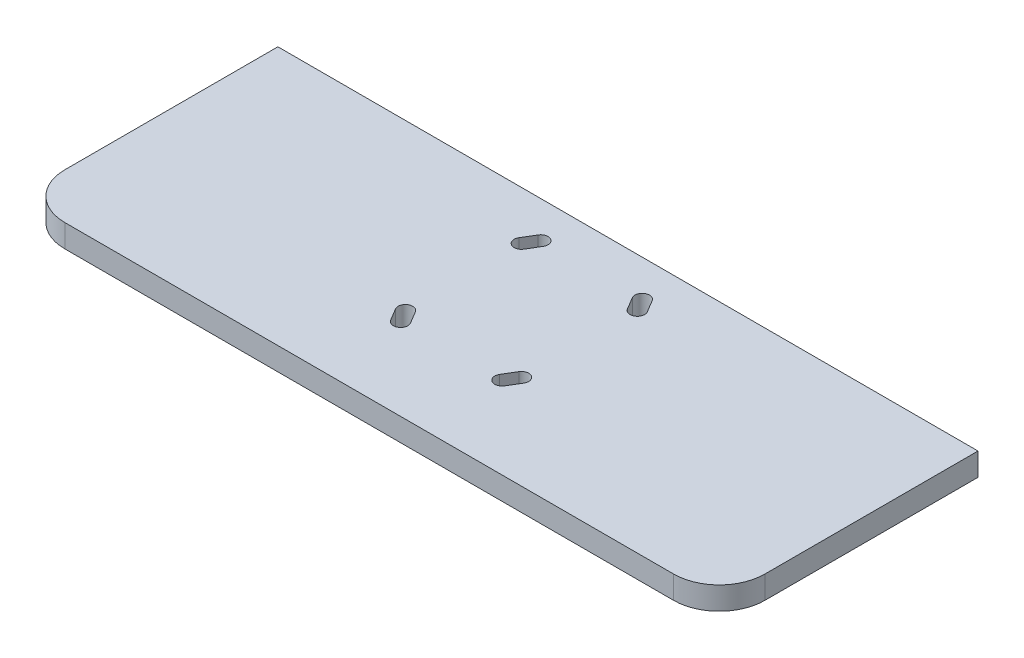
ISO-10303-21;
HEADER;
FILE_DESCRIPTION(('STEP AP214'),'2;1');
FILE_NAME('part.step','',(''),(''),'','','');
FILE_SCHEMA(('AUTOMOTIVE_DESIGN { 1 0 10303 214 1 1 1 1 }'));
ENDSEC;
DATA;
#1=APPLICATION_CONTEXT('core data for automotive mechanical design processes');
#2=APPLICATION_PROTOCOL_DEFINITION('international standard','automotive_design',2000,#1);
#3=PRODUCT_CONTEXT('',#1,'mechanical');
#4=PRODUCT('Part','Part','',(#3));
#5=PRODUCT_RELATED_PRODUCT_CATEGORY('part','',(#4));
#6=PRODUCT_DEFINITION_FORMATION('','',#4);
#7=PRODUCT_DEFINITION_CONTEXT('part definition',#1,'design');
#8=PRODUCT_DEFINITION('design','',#6,#7);
#9=PRODUCT_DEFINITION_SHAPE('','',#8);
#10=(LENGTH_UNIT() NAMED_UNIT(*) SI_UNIT(.MILLI.,.METRE.));
#11=(NAMED_UNIT(*) PLANE_ANGLE_UNIT() SI_UNIT($,.RADIAN.));
#12=(NAMED_UNIT(*) SI_UNIT($,.STERADIAN.) SOLID_ANGLE_UNIT());
#13=UNCERTAINTY_MEASURE_WITH_UNIT(LENGTH_MEASURE(1.E-05),#10,'distance_accuracy_value','');
#14=(GEOMETRIC_REPRESENTATION_CONTEXT(3) GLOBAL_UNCERTAINTY_ASSIGNED_CONTEXT((#13)) GLOBAL_UNIT_ASSIGNED_CONTEXT((#10,
#11,#12)) REPRESENTATION_CONTEXT('',''));
#15=CARTESIAN_POINT('',(0.,0.,0.));
#16=DIRECTION('',(0.,0.,1.));
#17=DIRECTION('',(1.,0.,0.));
#18=AXIS2_PLACEMENT_3D('',#15,#16,#17);
#19=CARTESIAN_POINT('',(230.,15.,70.));
#20=DIRECTION('',(-1.,0.,0.));
#21=DIRECTION('',(0.,0.,1.));
#22=AXIS2_PLACEMENT_3D('',#19,#20,#21);
#23=PLANE('',#22);
#24=DIRECTION('',(0.,0.,-1.));
#25=VECTOR('',#24,1.);
#26=CARTESIAN_POINT('',(230.,0.,70.));
#27=LINE('',#26,#25);
#28=CARTESIAN_POINT('',(230.,0.,70.));
#29=VERTEX_POINT('',#28);
#30=CARTESIAN_POINT('',(230.,0.,-70.));
#31=VERTEX_POINT('',#30);
#32=EDGE_CURVE('E202',#29,#31,#27,.T.);
#33=ORIENTED_EDGE('',*,*,#32,.T.);
#34=DIRECTION('',(0.,1.,0.));
#35=VECTOR('',#34,1.);
#36=CARTESIAN_POINT('',(230.,15.,-69.9999999999999));
#37=LINE('',#36,#35);
#38=CARTESIAN_POINT('',(230.,15.,-69.9999999999999));
#39=VERTEX_POINT('',#38);
#40=EDGE_CURVE('E50',#31,#39,#37,.T.);
#41=ORIENTED_EDGE('',*,*,#40,.T.);
#42=DIRECTION('',(0.,0.,-1.));
#43=VECTOR('',#42,1.);
#44=CARTESIAN_POINT('',(230.,15.,70.));
#45=LINE('',#44,#43);
#46=CARTESIAN_POINT('',(230.,15.,70.));
#47=VERTEX_POINT('',#46);
#48=EDGE_CURVE('E213',#47,#39,#45,.T.);
#49=ORIENTED_EDGE('',*,*,#48,.F.);
#50=DIRECTION('',(0.,-1.,0.));
#51=VECTOR('',#50,1.);
#52=CARTESIAN_POINT('',(230.,15.,70.));
#53=LINE('',#52,#51);
#54=EDGE_CURVE('E214',#47,#29,#53,.T.);
#55=ORIENTED_EDGE('',*,*,#54,.T.);
#56=EDGE_LOOP('',(#33,#41,#49,#55));
#57=FACE_BOUND('',#56,.T.);
#58=ADVANCED_FACE('F37',(#57),#23,.F.);
#59=CARTESIAN_POINT('',(-230.,15.,70.));
#60=DIRECTION('',(1.,0.,0.));
#61=DIRECTION('',(0.,0.,-1.));
#62=AXIS2_PLACEMENT_3D('',#59,#60,#61);
#63=PLANE('',#62);
#64=DIRECTION('',(0.,0.,1.));
#65=VECTOR('',#64,1.);
#66=CARTESIAN_POINT('',(-230.,15.,70.));
#67=LINE('',#66,#65);
#68=CARTESIAN_POINT('',(-230.,15.,-70.));
#69=VERTEX_POINT('',#68);
#70=CARTESIAN_POINT('',(-230.,15.,70.));
#71=VERTEX_POINT('',#70);
#72=EDGE_CURVE('E195',#69,#71,#67,.T.);
#73=ORIENTED_EDGE('',*,*,#72,.F.);
#74=DIRECTION('',(0.,-1.,0.));
#75=VECTOR('',#74,1.);
#76=CARTESIAN_POINT('',(-230.,15.,-70.));
#77=LINE('',#76,#75);
#78=CARTESIAN_POINT('',(-230.,0.,-70.));
#79=VERTEX_POINT('',#78);
#80=EDGE_CURVE('E183',#69,#79,#77,.T.);
#81=ORIENTED_EDGE('',*,*,#80,.T.);
#82=DIRECTION('',(0.,0.,1.));
#83=VECTOR('',#82,1.);
#84=CARTESIAN_POINT('',(-230.,0.,70.));
#85=LINE('',#84,#83);
#86=CARTESIAN_POINT('',(-230.,0.,70.));
#87=VERTEX_POINT('',#86);
#88=EDGE_CURVE('E193',#79,#87,#85,.T.);
#89=ORIENTED_EDGE('',*,*,#88,.T.);
#90=DIRECTION('',(0.,-1.,0.));
#91=VECTOR('',#90,1.);
#92=CARTESIAN_POINT('',(-230.,15.,70.));
#93=LINE('',#92,#91);
#94=EDGE_CURVE('E44',#71,#87,#93,.T.);
#95=ORIENTED_EDGE('',*,*,#94,.F.);
#96=EDGE_LOOP('',(#73,#81,#89,#95));
#97=FACE_BOUND('',#96,.T.);
#98=ADVANCED_FACE('F191',(#97),#63,.F.);
#99=CARTESIAN_POINT('',(-200.,15.,70.));
#100=DIRECTION('',(0.,-1.,0.));
#101=DIRECTION('',(0.,0.,-1.));
#102=AXIS2_PLACEMENT_3D('',#99,#100,#101);
#103=CYLINDRICAL_SURFACE('',#102,30.);
#104=CARTESIAN_POINT('',(-200.,0.,70.));
#105=DIRECTION('',(0.,1.,0.));
#106=DIRECTION('',(0.,0.,-1.));
#107=AXIS2_PLACEMENT_3D('',#104,#105,#106);
#108=CIRCLE('',#107,30.);
#109=CARTESIAN_POINT('',(-200.,0.,100.));
#110=VERTEX_POINT('',#109);
#111=EDGE_CURVE('E201',#87,#110,#108,.T.);
#112=ORIENTED_EDGE('',*,*,#111,.T.);
#113=DIRECTION('',(0.,-1.,0.));
#114=VECTOR('',#113,1.);
#115=CARTESIAN_POINT('',(-200.,15.,100.));
#116=LINE('',#115,#114);
#117=CARTESIAN_POINT('',(-200.,15.,100.));
#118=VERTEX_POINT('',#117);
#119=EDGE_CURVE('E221',#118,#110,#116,.T.);
#120=ORIENTED_EDGE('',*,*,#119,.F.);
#121=CARTESIAN_POINT('',(-200.,15.,70.));
#122=DIRECTION('',(0.,1.,0.));
#123=DIRECTION('',(0.,0.,-1.));
#124=AXIS2_PLACEMENT_3D('',#121,#122,#123);
#125=CIRCLE('',#124,30.);
#126=EDGE_CURVE('E227',#71,#118,#125,.T.);
#127=ORIENTED_EDGE('',*,*,#126,.F.);
#128=ORIENTED_EDGE('',*,*,#94,.T.);
#129=EDGE_LOOP('',(#112,#120,#127,#128));
#130=FACE_BOUND('',#129,.T.);
#131=ADVANCED_FACE('F225',(#130),#103,.T.);
#132=CARTESIAN_POINT('',(-200.,15.,100.));
#133=DIRECTION('',(0.,0.,-1.));
#134=DIRECTION('',(-1.,0.,0.));
#135=AXIS2_PLACEMENT_3D('',#132,#133,#134);
#136=PLANE('',#135);
#137=DIRECTION('',(1.,0.,0.));
#138=VECTOR('',#137,1.);
#139=CARTESIAN_POINT('',(-200.,0.,100.));
#140=LINE('',#139,#138);
#141=CARTESIAN_POINT('',(200.,0.,100.));
#142=VERTEX_POINT('',#141);
#143=EDGE_CURVE('E204',#110,#142,#140,.T.);
#144=ORIENTED_EDGE('',*,*,#143,.T.);
#145=DIRECTION('',(0.,-1.,0.));
#146=VECTOR('',#145,1.);
#147=CARTESIAN_POINT('',(200.,15.,100.));
#148=LINE('',#147,#146);
#149=CARTESIAN_POINT('',(200.,15.,100.));
#150=VERTEX_POINT('',#149);
#151=EDGE_CURVE('E217',#150,#142,#148,.T.);
#152=ORIENTED_EDGE('',*,*,#151,.F.);
#153=DIRECTION('',(1.,0.,0.));
#154=VECTOR('',#153,1.);
#155=CARTESIAN_POINT('',(-200.,15.,100.));
#156=LINE('',#155,#154);
#157=EDGE_CURVE('E230',#118,#150,#156,.T.);
#158=ORIENTED_EDGE('',*,*,#157,.F.);
#159=ORIENTED_EDGE('',*,*,#119,.T.);
#160=EDGE_LOOP('',(#144,#152,#158,#159));
#161=FACE_BOUND('',#160,.T.);
#162=ADVANCED_FACE('F431',(#161),#136,.F.);
#163=CARTESIAN_POINT('',(200.,15.,70.));
#164=DIRECTION('',(0.,-1.,0.));
#165=DIRECTION('',(0.,0.,-1.));
#166=AXIS2_PLACEMENT_3D('',#163,#164,#165);
#167=CYLINDRICAL_SURFACE('',#166,30.);
#168=CARTESIAN_POINT('',(200.,0.,70.));
#169=DIRECTION('',(0.,1.,0.));
#170=DIRECTION('',(0.,0.,1.));
#171=AXIS2_PLACEMENT_3D('',#168,#169,#170);
#172=CIRCLE('',#171,30.);
#173=EDGE_CURVE('E211',#142,#29,#172,.T.);
#174=ORIENTED_EDGE('',*,*,#173,.T.);
#175=ORIENTED_EDGE('',*,*,#54,.F.);
#176=CARTESIAN_POINT('',(200.,15.,70.));
#177=DIRECTION('',(0.,1.,0.));
#178=DIRECTION('',(0.,0.,1.));
#179=AXIS2_PLACEMENT_3D('',#176,#177,#178);
#180=CIRCLE('',#179,30.);
#181=EDGE_CURVE('E218',#150,#47,#180,.T.);
#182=ORIENTED_EDGE('',*,*,#181,.F.);
#183=ORIENTED_EDGE('',*,*,#151,.T.);
#184=EDGE_LOOP('',(#174,#175,#182,#183));
#185=FACE_BOUND('',#184,.T.);
#186=ADVANCED_FACE('F242',(#185),#167,.T.);
#187=CARTESIAN_POINT('',(-200.,15.,70.));
#188=DIRECTION('',(0.,-1.,0.));
#189=DIRECTION('',(0.,0.,-1.));
#190=AXIS2_PLACEMENT_3D('',#187,#188,#189);
#191=PLANE('',#190);
#192=DIRECTION('',(0.514495755427524,0.,0.857492925712546));
#193=VECTOR('',#192,1.);
#194=CARTESIAN_POINT('',(-42.1838100587061,15.,40.5502860352223));
#195=LINE('',#194,#193);
#196=CARTESIAN_POINT('',(-42.1838100587061,15.,40.5502860352223));
#197=VERTEX_POINT('',#196);
#198=CARTESIAN_POINT('',(-37.4213100587049,15.,48.4877860352244));
#199=VERTEX_POINT('',#198);
#200=EDGE_CURVE('E261',#197,#199,#195,.T.);
#201=ORIENTED_EDGE('',*,*,#200,.F.);
#202=CARTESIAN_POINT('',(-38.1000000000001,15.,38.0999999999987));
#203=DIRECTION('',(0.,1.,0.));
#204=DIRECTION('',(0.,0.,1.));
#205=AXIS2_PLACEMENT_3D('',#202,#203,#204);
#206=CIRCLE('',#205,4.7625);
#207=CARTESIAN_POINT('',(-34.0161899412941,15.,35.6497139647752));
#208=VERTEX_POINT('',#207);
#209=EDGE_CURVE('E58',#208,#197,#206,.T.);
#210=ORIENTED_EDGE('',*,*,#209,.F.);
#211=DIRECTION('',(-0.514495755427524,0.,-0.857492925712546));
#212=VECTOR('',#211,1.);
#213=CARTESIAN_POINT('',(-34.0161899412941,15.,35.6497139647752));
#214=LINE('',#213,#212);
#215=CARTESIAN_POINT('',(-29.2536899412929,15.,43.5872139647772));
#216=VERTEX_POINT('',#215);
#217=EDGE_CURVE('E254',#216,#208,#214,.T.);
#218=ORIENTED_EDGE('',*,*,#217,.F.);
#219=CARTESIAN_POINT('',(-33.3374999999989,15.,46.0375000000008));
#220=DIRECTION('',(0.,1.,0.));
#221=DIRECTION('',(0.,0.,1.));
#222=AXIS2_PLACEMENT_3D('',#219,#220,#221);
#223=CIRCLE('',#222,4.7625);
#224=EDGE_CURVE('E258',#199,#216,#223,.T.);
#225=ORIENTED_EDGE('',*,*,#224,.F.);
#226=EDGE_LOOP('',(#201,#210,#218,#225));
#227=FACE_BOUND('',#226,.T.);
#228=DIRECTION('',(-0.51449575542756,0.,-0.857492925712524));
#229=VECTOR('',#228,1.);
#230=CARTESIAN_POINT('',(42.1838100587054,15.,-40.5502860352235));
#231=LINE('',#230,#229);
#232=CARTESIAN_POINT('',(42.1838100587054,15.,-40.5502860352235));
#233=VERTEX_POINT('',#232);
#234=CARTESIAN_POINT('',(37.4213100587051,15.,-48.4877860352233));
#235=VERTEX_POINT('',#234);
#236=EDGE_CURVE('E356',#233,#235,#231,.T.);
#237=ORIENTED_EDGE('',*,*,#236,.F.);
#238=CARTESIAN_POINT('',(38.0999999999997,15.,-38.0999999999999));
#239=DIRECTION('',(0.,1.,0.));
#240=DIRECTION('',(0.,0.,1.));
#241=AXIS2_PLACEMENT_3D('',#238,#239,#240);
#242=CIRCLE('',#241,4.76249999999982);
#243=CARTESIAN_POINT('',(34.0161899412939,15.,-35.6497139647762));
#244=VERTEX_POINT('',#243);
#245=EDGE_CURVE('E359',#244,#233,#242,.T.);
#246=ORIENTED_EDGE('',*,*,#245,.F.);
#247=DIRECTION('',(0.51449575542756,0.,0.857492925712524));
#248=VECTOR('',#247,1.);
#249=CARTESIAN_POINT('',(34.0161899412939,15.,-35.6497139647762));
#250=LINE('',#249,#248);
#251=CARTESIAN_POINT('',(29.2536899412936,15.,-43.587213964776));
#252=VERTEX_POINT('',#251);
#253=EDGE_CURVE('E349',#252,#244,#250,.T.);
#254=ORIENTED_EDGE('',*,*,#253,.F.);
#255=CARTESIAN_POINT('',(33.3374999999994,15.,-46.0374999999997));
#256=DIRECTION('',(0.,1.,0.));
#257=DIRECTION('',(0.,0.,1.));
#258=AXIS2_PLACEMENT_3D('',#255,#256,#257);
#259=CIRCLE('',#258,4.76249999999982);
#260=EDGE_CURVE('E353',#235,#252,#259,.T.);
#261=ORIENTED_EDGE('',*,*,#260,.F.);
#262=EDGE_LOOP('',(#237,#246,#254,#261));
#263=FACE_BOUND('',#262,.T.);
#264=DIRECTION('',(0.514495755427523,0.,-0.857492925712546));
#265=VECTOR('',#264,1.);
#266=CARTESIAN_POINT('',(-34.0161899412935,15.,-35.6497139647762));
#267=LINE('',#266,#265);
#268=CARTESIAN_POINT('',(-34.0161899412935,15.,-35.6497139647762));
#269=VERTEX_POINT('',#268);
#270=CARTESIAN_POINT('',(-29.2536899412935,15.,-43.5872139647762));
#271=VERTEX_POINT('',#270);
#272=EDGE_CURVE('E294',#269,#271,#267,.T.);
#273=ORIENTED_EDGE('',*,*,#272,.F.);
#274=CARTESIAN_POINT('',(-38.0999999999995,15.,-38.0999999999998));
#275=DIRECTION('',(0.,1.,0.));
#276=DIRECTION('',(0.,0.,-1.));
#277=AXIS2_PLACEMENT_3D('',#274,#275,#276);
#278=CIRCLE('',#277,4.76250000000001);
#279=CARTESIAN_POINT('',(-42.1838100587055,15.,-40.5502860352233));
#280=VERTEX_POINT('',#279);
#281=EDGE_CURVE('E297',#280,#269,#278,.T.);
#282=ORIENTED_EDGE('',*,*,#281,.F.);
#283=DIRECTION('',(-0.514495755427523,0.,0.857492925712546));
#284=VECTOR('',#283,1.);
#285=CARTESIAN_POINT('',(-42.1838100587055,15.,-40.5502860352233));
#286=LINE('',#285,#284);
#287=CARTESIAN_POINT('',(-37.4213100587055,15.,-48.4877860352234));
#288=VERTEX_POINT('',#287);
#289=EDGE_CURVE('E287',#288,#280,#286,.T.);
#290=ORIENTED_EDGE('',*,*,#289,.F.);
#291=CARTESIAN_POINT('',(-33.3374999999995,15.,-46.0374999999998));
#292=DIRECTION('',(0.,1.,0.));
#293=DIRECTION('',(0.,0.,-1.));
#294=AXIS2_PLACEMENT_3D('',#291,#292,#293);
#295=CIRCLE('',#294,4.76250000000001);
#296=EDGE_CURVE('E291',#271,#288,#295,.T.);
#297=ORIENTED_EDGE('',*,*,#296,.F.);
#298=EDGE_LOOP('',(#273,#282,#290,#297));
#299=FACE_BOUND('',#298,.T.);
#300=DIRECTION('',(-0.514495755427526,0.,0.857492925712545));
#301=VECTOR('',#300,1.);
#302=CARTESIAN_POINT('',(34.0161899412934,15.,35.6497139647765));
#303=LINE('',#302,#301);
#304=CARTESIAN_POINT('',(34.0161899412934,15.,35.6497139647764));
#305=VERTEX_POINT('',#304);
#306=CARTESIAN_POINT('',(29.2536899412937,15.,43.587213964776));
#307=VERTEX_POINT('',#306);
#308=EDGE_CURVE('E326',#305,#307,#303,.T.);
#309=ORIENTED_EDGE('',*,*,#308,.F.);
#310=CARTESIAN_POINT('',(38.0999999999994,15.,38.1));
#311=DIRECTION('',(0.,1.,0.));
#312=DIRECTION('',(0.,0.,-1.));
#313=AXIS2_PLACEMENT_3D('',#310,#311,#312);
#314=CIRCLE('',#313,4.76249999999992);
#315=CARTESIAN_POINT('',(42.1838100587053,15.,40.5502860352236));
#316=VERTEX_POINT('',#315);
#317=EDGE_CURVE('E286',#316,#305,#314,.T.);
#318=ORIENTED_EDGE('',*,*,#317,.F.);
#319=DIRECTION('',(0.514495755427526,0.,-0.857492925712545));
#320=VECTOR('',#319,1.);
#321=CARTESIAN_POINT('',(42.1838100587053,15.,40.5502860352236));
#322=LINE('',#321,#320);
#323=CARTESIAN_POINT('',(37.4213100587056,15.,48.4877860352231));
#324=VERTEX_POINT('',#323);
#325=EDGE_CURVE('E319',#324,#316,#322,.T.);
#326=ORIENTED_EDGE('',*,*,#325,.F.);
#327=CARTESIAN_POINT('',(33.3374999999997,15.,46.0374999999995));
#328=DIRECTION('',(0.,1.,0.));
#329=DIRECTION('',(0.,0.,-1.));
#330=AXIS2_PLACEMENT_3D('',#327,#328,#329);
#331=CIRCLE('',#330,4.76249999999992);
#332=EDGE_CURVE('E323',#307,#324,#331,.T.);
#333=ORIENTED_EDGE('',*,*,#332,.F.);
#334=EDGE_LOOP('',(#309,#318,#326,#333));
#335=FACE_BOUND('',#334,.T.);
#336=ORIENTED_EDGE('',*,*,#48,.T.);
#337=DIRECTION('',(-1.,0.,0.));
#338=VECTOR('',#337,1.);
#339=CARTESIAN_POINT('',(-200.,15.,-70.));
#340=LINE('',#339,#338);
#341=EDGE_CURVE('E361',#39,#69,#340,.T.);
#342=ORIENTED_EDGE('',*,*,#341,.T.);
#343=ORIENTED_EDGE('',*,*,#72,.T.);
#344=ORIENTED_EDGE('',*,*,#126,.T.);
#345=ORIENTED_EDGE('',*,*,#157,.T.);
#346=ORIENTED_EDGE('',*,*,#181,.T.);
#347=EDGE_LOOP('',(#336,#342,#343,#344,#345,#346));
#348=FACE_BOUND('',#347,.T.);
#349=ADVANCED_FACE('F238',(#227,#263,#299,#335,#348),#191,.F.);
#350=CARTESIAN_POINT('',(-200.,0.,70.));
#351=DIRECTION('',(0.,-1.,0.));
#352=DIRECTION('',(0.,0.,-1.));
#353=AXIS2_PLACEMENT_3D('',#350,#351,#352);
#354=PLANE('',#353);
#355=DIRECTION('',(-1.,0.,0.));
#356=VECTOR('',#355,1.);
#357=CARTESIAN_POINT('',(-200.,0.,-70.));
#358=LINE('',#357,#356);
#359=EDGE_CURVE('E11',#31,#79,#358,.T.);
#360=ORIENTED_EDGE('',*,*,#359,.F.);
#361=ORIENTED_EDGE('',*,*,#32,.F.);
#362=ORIENTED_EDGE('',*,*,#173,.F.);
#363=ORIENTED_EDGE('',*,*,#143,.F.);
#364=ORIENTED_EDGE('',*,*,#111,.F.);
#365=ORIENTED_EDGE('',*,*,#88,.F.);
#366=EDGE_LOOP('',(#360,#361,#362,#363,#364,#365));
#367=FACE_BOUND('',#366,.T.);
#368=CARTESIAN_POINT('',(-38.1000000000001,0.,38.0999999999987));
#369=DIRECTION('',(0.,1.,0.));
#370=DIRECTION('',(0.,0.,1.));
#371=AXIS2_PLACEMENT_3D('',#368,#369,#370);
#372=CIRCLE('',#371,4.7625);
#373=CARTESIAN_POINT('',(-34.0161899412941,0.,35.6497139647752));
#374=VERTEX_POINT('',#373);
#375=CARTESIAN_POINT('',(-42.1838100587061,0.,40.5502860352223));
#376=VERTEX_POINT('',#375);
#377=EDGE_CURVE('E257',#374,#376,#372,.T.);
#378=ORIENTED_EDGE('',*,*,#377,.T.);
#379=DIRECTION('',(0.514495755427524,0.,0.857492925712546));
#380=VECTOR('',#379,1.);
#381=CARTESIAN_POINT('',(-42.1838100587061,0.,40.5502860352223));
#382=LINE('',#381,#380);
#383=CARTESIAN_POINT('',(-37.4213100587049,0.,48.4877860352244));
#384=VERTEX_POINT('',#383);
#385=EDGE_CURVE('E271',#376,#384,#382,.T.);
#386=ORIENTED_EDGE('',*,*,#385,.T.);
#387=CARTESIAN_POINT('',(-33.3374999999989,0.,46.0375000000008));
#388=DIRECTION('',(0.,1.,0.));
#389=DIRECTION('',(0.,0.,1.));
#390=AXIS2_PLACEMENT_3D('',#387,#388,#389);
#391=CIRCLE('',#390,4.7625);
#392=CARTESIAN_POINT('',(-29.2536899412929,0.,43.5872139647772));
#393=VERTEX_POINT('',#392);
#394=EDGE_CURVE('E268',#384,#393,#391,.T.);
#395=ORIENTED_EDGE('',*,*,#394,.T.);
#396=DIRECTION('',(-0.514495755427524,0.,-0.857492925712546));
#397=VECTOR('',#396,1.);
#398=CARTESIAN_POINT('',(-34.0161899412941,0.,35.6497139647752));
#399=LINE('',#398,#397);
#400=EDGE_CURVE('E249',#393,#374,#399,.T.);
#401=ORIENTED_EDGE('',*,*,#400,.T.);
#402=EDGE_LOOP('',(#378,#386,#395,#401));
#403=FACE_BOUND('',#402,.T.);
#404=CARTESIAN_POINT('',(38.0999999999997,0.,-38.0999999999999));
#405=DIRECTION('',(0.,1.,0.));
#406=DIRECTION('',(0.,0.,1.));
#407=AXIS2_PLACEMENT_3D('',#404,#405,#406);
#408=CIRCLE('',#407,4.76249999999982);
#409=CARTESIAN_POINT('',(34.0161899412939,0.,-35.6497139647762));
#410=VERTEX_POINT('',#409);
#411=CARTESIAN_POINT('',(42.1838100587054,0.,-40.5502860352235));
#412=VERTEX_POINT('',#411);
#413=EDGE_CURVE('E352',#410,#412,#408,.T.);
#414=ORIENTED_EDGE('',*,*,#413,.T.);
#415=DIRECTION('',(-0.51449575542756,0.,-0.857492925712524));
#416=VECTOR('',#415,1.);
#417=CARTESIAN_POINT('',(42.1838100587054,0.,-40.5502860352235));
#418=LINE('',#417,#416);
#419=CARTESIAN_POINT('',(37.4213100587051,0.,-48.4877860352233));
#420=VERTEX_POINT('',#419);
#421=EDGE_CURVE('E367',#412,#420,#418,.T.);
#422=ORIENTED_EDGE('',*,*,#421,.T.);
#423=CARTESIAN_POINT('',(33.3374999999994,0.,-46.0374999999997));
#424=DIRECTION('',(0.,1.,0.));
#425=DIRECTION('',(0.,0.,1.));
#426=AXIS2_PLACEMENT_3D('',#423,#424,#425);
#427=CIRCLE('',#426,4.76249999999982);
#428=CARTESIAN_POINT('',(29.2536899412936,0.,-43.587213964776));
#429=VERTEX_POINT('',#428);
#430=EDGE_CURVE('E364',#420,#429,#427,.T.);
#431=ORIENTED_EDGE('',*,*,#430,.T.);
#432=DIRECTION('',(0.51449575542756,0.,0.857492925712524));
#433=VECTOR('',#432,1.);
#434=CARTESIAN_POINT('',(34.0161899412939,0.,-35.6497139647762));
#435=LINE('',#434,#433);
#436=EDGE_CURVE('E344',#429,#410,#435,.T.);
#437=ORIENTED_EDGE('',*,*,#436,.T.);
#438=EDGE_LOOP('',(#414,#422,#431,#437));
#439=FACE_BOUND('',#438,.T.);
#440=CARTESIAN_POINT('',(-38.0999999999995,0.,-38.0999999999998));
#441=DIRECTION('',(0.,1.,0.));
#442=DIRECTION('',(0.,0.,-1.));
#443=AXIS2_PLACEMENT_3D('',#440,#441,#442);
#444=CIRCLE('',#443,4.76250000000001);
#445=CARTESIAN_POINT('',(-42.1838100587055,0.,-40.5502860352233));
#446=VERTEX_POINT('',#445);
#447=CARTESIAN_POINT('',(-34.0161899412935,0.,-35.6497139647762));
#448=VERTEX_POINT('',#447);
#449=EDGE_CURVE('E290',#446,#448,#444,.T.);
#450=ORIENTED_EDGE('',*,*,#449,.T.);
#451=DIRECTION('',(0.514495755427523,0.,-0.857492925712546));
#452=VECTOR('',#451,1.);
#453=CARTESIAN_POINT('',(-34.0161899412935,0.,-35.6497139647762));
#454=LINE('',#453,#452);
#455=CARTESIAN_POINT('',(-29.2536899412935,0.,-43.5872139647762));
#456=VERTEX_POINT('',#455);
#457=EDGE_CURVE('E305',#448,#456,#454,.T.);
#458=ORIENTED_EDGE('',*,*,#457,.T.);
#459=CARTESIAN_POINT('',(-33.3374999999995,0.,-46.0374999999998));
#460=DIRECTION('',(0.,1.,0.));
#461=DIRECTION('',(0.,0.,-1.));
#462=AXIS2_PLACEMENT_3D('',#459,#460,#461);
#463=CIRCLE('',#462,4.76250000000001);
#464=CARTESIAN_POINT('',(-37.4213100587055,0.,-48.4877860352234));
#465=VERTEX_POINT('',#464);
#466=EDGE_CURVE('E302',#456,#465,#463,.T.);
#467=ORIENTED_EDGE('',*,*,#466,.T.);
#468=DIRECTION('',(-0.514495755427523,0.,0.857492925712546));
#469=VECTOR('',#468,1.);
#470=CARTESIAN_POINT('',(-42.1838100587055,0.,-40.5502860352233));
#471=LINE('',#470,#469);
#472=EDGE_CURVE('E280',#465,#446,#471,.T.);
#473=ORIENTED_EDGE('',*,*,#472,.T.);
#474=EDGE_LOOP('',(#450,#458,#467,#473));
#475=FACE_BOUND('',#474,.T.);
#476=CARTESIAN_POINT('',(38.0999999999994,0.,38.1));
#477=DIRECTION('',(0.,1.,0.));
#478=DIRECTION('',(0.,0.,-1.));
#479=AXIS2_PLACEMENT_3D('',#476,#477,#478);
#480=CIRCLE('',#479,4.76249999999992);
#481=CARTESIAN_POINT('',(42.1838100587053,0.,40.5502860352236));
#482=VERTEX_POINT('',#481);
#483=CARTESIAN_POINT('',(34.0161899412934,0.,35.6497139647765));
#484=VERTEX_POINT('',#483);
#485=EDGE_CURVE('E322',#482,#484,#480,.T.);
#486=ORIENTED_EDGE('',*,*,#485,.T.);
#487=DIRECTION('',(-0.514495755427526,0.,0.857492925712545));
#488=VECTOR('',#487,1.);
#489=CARTESIAN_POINT('',(34.0161899412934,0.,35.6497139647765));
#490=LINE('',#489,#488);
#491=CARTESIAN_POINT('',(29.2536899412937,0.,43.587213964776));
#492=VERTEX_POINT('',#491);
#493=EDGE_CURVE('E335',#484,#492,#490,.T.);
#494=ORIENTED_EDGE('',*,*,#493,.T.);
#495=CARTESIAN_POINT('',(33.3374999999997,0.,46.0374999999995));
#496=DIRECTION('',(0.,1.,0.));
#497=DIRECTION('',(0.,0.,-1.));
#498=AXIS2_PLACEMENT_3D('',#495,#496,#497);
#499=CIRCLE('',#498,4.76249999999992);
#500=CARTESIAN_POINT('',(37.4213100587056,0.,48.4877860352231));
#501=VERTEX_POINT('',#500);
#502=EDGE_CURVE('E332',#492,#501,#499,.T.);
#503=ORIENTED_EDGE('',*,*,#502,.T.);
#504=DIRECTION('',(0.514495755427526,0.,-0.857492925712545));
#505=VECTOR('',#504,1.);
#506=CARTESIAN_POINT('',(42.1838100587053,0.,40.5502860352236));
#507=LINE('',#506,#505);
#508=EDGE_CURVE('E314',#501,#482,#507,.T.);
#509=ORIENTED_EDGE('',*,*,#508,.T.);
#510=EDGE_LOOP('',(#486,#494,#503,#509));
#511=FACE_BOUND('',#510,.T.);
#512=ADVANCED_FACE('F198',(#367,#403,#439,#475,#511),#354,.T.);
#513=CARTESIAN_POINT('',(38.0999999999994,0.,38.1));
#514=DIRECTION('',(0.,1.,0.));
#515=DIRECTION('',(0.,0.,1.));
#516=AXIS2_PLACEMENT_3D('',#513,#514,#515);
#517=CYLINDRICAL_SURFACE('',#516,4.76249999999992);
#518=ORIENTED_EDGE('',*,*,#317,.T.);
#519=DIRECTION('',(0.,1.,0.));
#520=VECTOR('',#519,1.);
#521=CARTESIAN_POINT('',(34.0161899412934,0.,35.6497139647765));
#522=LINE('',#521,#520);
#523=EDGE_CURVE('E310',#484,#305,#522,.T.);
#524=ORIENTED_EDGE('',*,*,#523,.F.);
#525=ORIENTED_EDGE('',*,*,#485,.F.);
#526=DIRECTION('',(0.,1.,0.));
#527=VECTOR('',#526,1.);
#528=CARTESIAN_POINT('',(42.1838100587053,0.,40.5502860352236));
#529=LINE('',#528,#527);
#530=EDGE_CURVE('E265',#482,#316,#529,.T.);
#531=ORIENTED_EDGE('',*,*,#530,.T.);
#532=EDGE_LOOP('',(#518,#524,#525,#531));
#533=FACE_BOUND('',#532,.T.);
#534=ADVANCED_FACE('F410',(#533),#517,.F.);
#535=CARTESIAN_POINT('',(42.1838100587053,0.,40.5502860352236));
#536=DIRECTION('',(0.857492925712545,0.,0.514495755427526));
#537=DIRECTION('',(0.514495755427526,0.,-0.857492925712545));
#538=AXIS2_PLACEMENT_3D('',#535,#536,#537);
#539=PLANE('',#538);
#540=ORIENTED_EDGE('',*,*,#325,.T.);
#541=ORIENTED_EDGE('',*,*,#530,.F.);
#542=ORIENTED_EDGE('',*,*,#508,.F.);
#543=DIRECTION('',(0.,1.,0.));
#544=VECTOR('',#543,1.);
#545=CARTESIAN_POINT('',(37.4213100587056,0.,48.4877860352231));
#546=LINE('',#545,#544);
#547=EDGE_CURVE('E316',#501,#324,#546,.T.);
#548=ORIENTED_EDGE('',*,*,#547,.T.);
#549=EDGE_LOOP('',(#540,#541,#542,#548));
#550=FACE_BOUND('',#549,.T.);
#551=ADVANCED_FACE('F413',(#550),#539,.F.);
#552=CARTESIAN_POINT('',(33.3374999999997,0.,46.0374999999995));
#553=DIRECTION('',(0.,1.,0.));
#554=DIRECTION('',(0.,0.,1.));
#555=AXIS2_PLACEMENT_3D('',#552,#553,#554);
#556=CYLINDRICAL_SURFACE('',#555,4.76249999999992);
#557=ORIENTED_EDGE('',*,*,#332,.T.);
#558=ORIENTED_EDGE('',*,*,#547,.F.);
#559=ORIENTED_EDGE('',*,*,#502,.F.);
#560=DIRECTION('',(0.,1.,0.));
#561=VECTOR('',#560,1.);
#562=CARTESIAN_POINT('',(29.2536899412937,0.,43.587213964776));
#563=LINE('',#562,#561);
#564=EDGE_CURVE('E313',#492,#307,#563,.T.);
#565=ORIENTED_EDGE('',*,*,#564,.T.);
#566=EDGE_LOOP('',(#557,#558,#559,#565));
#567=FACE_BOUND('',#566,.T.);
#568=ADVANCED_FACE('F415',(#567),#556,.F.);
#569=CARTESIAN_POINT('',(34.0161899412934,0.,35.6497139647765));
#570=DIRECTION('',(-0.857492925712545,0.,-0.514495755427526));
#571=DIRECTION('',(-0.514495755427526,0.,0.857492925712545));
#572=AXIS2_PLACEMENT_3D('',#569,#570,#571);
#573=PLANE('',#572);
#574=ORIENTED_EDGE('',*,*,#308,.T.);
#575=ORIENTED_EDGE('',*,*,#564,.F.);
#576=ORIENTED_EDGE('',*,*,#493,.F.);
#577=ORIENTED_EDGE('',*,*,#523,.T.);
#578=EDGE_LOOP('',(#574,#575,#576,#577));
#579=FACE_BOUND('',#578,.T.);
#580=ADVANCED_FACE('F406',(#579),#573,.F.);
#581=CARTESIAN_POINT('',(-38.0999999999995,0.,-38.0999999999998));
#582=DIRECTION('',(0.,1.,0.));
#583=DIRECTION('',(0.,0.,1.));
#584=AXIS2_PLACEMENT_3D('',#581,#582,#583);
#585=CYLINDRICAL_SURFACE('',#584,4.76250000000001);
#586=ORIENTED_EDGE('',*,*,#281,.T.);
#587=DIRECTION('',(0.,1.,0.));
#588=VECTOR('',#587,1.);
#589=CARTESIAN_POINT('',(-34.0161899412935,0.,-35.6497139647762));
#590=LINE('',#589,#588);
#591=EDGE_CURVE('E276',#448,#269,#590,.T.);
#592=ORIENTED_EDGE('',*,*,#591,.F.);
#593=ORIENTED_EDGE('',*,*,#449,.F.);
#594=DIRECTION('',(0.,1.,0.));
#595=VECTOR('',#594,1.);
#596=CARTESIAN_POINT('',(-42.1838100587055,0.,-40.5502860352233));
#597=LINE('',#596,#595);
#598=EDGE_CURVE('E284',#446,#280,#597,.T.);
#599=ORIENTED_EDGE('',*,*,#598,.T.);
#600=EDGE_LOOP('',(#586,#592,#593,#599));
#601=FACE_BOUND('',#600,.T.);
#602=ADVANCED_FACE('F541',(#601),#585,.F.);
#603=CARTESIAN_POINT('',(-42.1838100587055,0.,-40.5502860352233));
#604=DIRECTION('',(-0.857492925712546,0.,-0.514495755427523));
#605=DIRECTION('',(-0.514495755427523,0.,0.857492925712546));
#606=AXIS2_PLACEMENT_3D('',#603,#604,#605);
#607=PLANE('',#606);
#608=ORIENTED_EDGE('',*,*,#289,.T.);
#609=ORIENTED_EDGE('',*,*,#598,.F.);
#610=ORIENTED_EDGE('',*,*,#472,.F.);
#611=DIRECTION('',(0.,1.,0.));
#612=VECTOR('',#611,1.);
#613=CARTESIAN_POINT('',(-37.4213100587055,0.,-48.4877860352234));
#614=LINE('',#613,#612);
#615=EDGE_CURVE('E282',#465,#288,#614,.T.);
#616=ORIENTED_EDGE('',*,*,#615,.T.);
#617=EDGE_LOOP('',(#608,#609,#610,#616));
#618=FACE_BOUND('',#617,.T.);
#619=ADVANCED_FACE('F533',(#618),#607,.F.);
#620=CARTESIAN_POINT('',(-33.3374999999995,0.,-46.0374999999998));
#621=DIRECTION('',(0.,1.,0.));
#622=DIRECTION('',(0.,0.,1.));
#623=AXIS2_PLACEMENT_3D('',#620,#621,#622);
#624=CYLINDRICAL_SURFACE('',#623,4.76250000000001);
#625=ORIENTED_EDGE('',*,*,#296,.T.);
#626=ORIENTED_EDGE('',*,*,#615,.F.);
#627=ORIENTED_EDGE('',*,*,#466,.F.);
#628=DIRECTION('',(0.,1.,0.));
#629=VECTOR('',#628,1.);
#630=CARTESIAN_POINT('',(-29.2536899412935,0.,-43.5872139647762));
#631=LINE('',#630,#629);
#632=EDGE_CURVE('E279',#456,#271,#631,.T.);
#633=ORIENTED_EDGE('',*,*,#632,.T.);
#634=EDGE_LOOP('',(#625,#626,#627,#633));
#635=FACE_BOUND('',#634,.T.);
#636=ADVANCED_FACE('F525',(#635),#624,.F.);
#637=CARTESIAN_POINT('',(-34.0161899412935,0.,-35.6497139647762));
#638=DIRECTION('',(0.857492925712546,0.,0.514495755427523));
#639=DIRECTION('',(0.514495755427523,0.,-0.857492925712546));
#640=AXIS2_PLACEMENT_3D('',#637,#638,#639);
#641=PLANE('',#640);
#642=ORIENTED_EDGE('',*,*,#272,.T.);
#643=ORIENTED_EDGE('',*,*,#632,.F.);
#644=ORIENTED_EDGE('',*,*,#457,.F.);
#645=ORIENTED_EDGE('',*,*,#591,.T.);
#646=EDGE_LOOP('',(#642,#643,#644,#645));
#647=FACE_BOUND('',#646,.T.);
#648=ADVANCED_FACE('F518',(#647),#641,.F.);
#649=CARTESIAN_POINT('',(38.0999999999997,0.,-38.0999999999999));
#650=DIRECTION('',(0.,1.,0.));
#651=DIRECTION('',(0.,0.,1.));
#652=AXIS2_PLACEMENT_3D('',#649,#650,#651);
#653=CYLINDRICAL_SURFACE('',#652,4.76249999999982);
#654=ORIENTED_EDGE('',*,*,#245,.T.);
#655=DIRECTION('',(0.,1.,0.));
#656=VECTOR('',#655,1.);
#657=CARTESIAN_POINT('',(42.1838100587054,0.,-40.5502860352235));
#658=LINE('',#657,#656);
#659=EDGE_CURVE('E340',#412,#233,#658,.T.);
#660=ORIENTED_EDGE('',*,*,#659,.F.);
#661=ORIENTED_EDGE('',*,*,#413,.F.);
#662=DIRECTION('',(0.,1.,0.));
#663=VECTOR('',#662,1.);
#664=CARTESIAN_POINT('',(34.0161899412939,0.,-35.6497139647762));
#665=LINE('',#664,#663);
#666=EDGE_CURVE('E299',#410,#244,#665,.T.);
#667=ORIENTED_EDGE('',*,*,#666,.T.);
#668=EDGE_LOOP('',(#654,#660,#661,#667));
#669=FACE_BOUND('',#668,.T.);
#670=ADVANCED_FACE('F379',(#669),#653,.F.);
#671=CARTESIAN_POINT('',(34.0161899412939,0.,-35.6497139647762));
#672=DIRECTION('',(-0.857492925712524,0.,0.51449575542756));
#673=DIRECTION('',(0.51449575542756,0.,0.857492925712524));
#674=AXIS2_PLACEMENT_3D('',#671,#672,#673);
#675=PLANE('',#674);
#676=ORIENTED_EDGE('',*,*,#253,.T.);
#677=ORIENTED_EDGE('',*,*,#666,.F.);
#678=ORIENTED_EDGE('',*,*,#436,.F.);
#679=DIRECTION('',(0.,1.,0.));
#680=VECTOR('',#679,1.);
#681=CARTESIAN_POINT('',(29.2536899412936,0.,-43.587213964776));
#682=LINE('',#681,#680);
#683=EDGE_CURVE('E346',#429,#252,#682,.T.);
#684=ORIENTED_EDGE('',*,*,#683,.T.);
#685=EDGE_LOOP('',(#676,#677,#678,#684));
#686=FACE_BOUND('',#685,.T.);
#687=ADVANCED_FACE('F390',(#686),#675,.F.);
#688=CARTESIAN_POINT('',(33.3374999999994,0.,-46.0374999999997));
#689=DIRECTION('',(0.,1.,0.));
#690=DIRECTION('',(0.,0.,1.));
#691=AXIS2_PLACEMENT_3D('',#688,#689,#690);
#692=CYLINDRICAL_SURFACE('',#691,4.76249999999982);
#693=ORIENTED_EDGE('',*,*,#260,.T.);
#694=ORIENTED_EDGE('',*,*,#683,.F.);
#695=ORIENTED_EDGE('',*,*,#430,.F.);
#696=DIRECTION('',(0.,1.,0.));
#697=VECTOR('',#696,1.);
#698=CARTESIAN_POINT('',(37.4213100587051,0.,-48.4877860352233));
#699=LINE('',#698,#697);
#700=EDGE_CURVE('E343',#420,#235,#699,.T.);
#701=ORIENTED_EDGE('',*,*,#700,.T.);
#702=EDGE_LOOP('',(#693,#694,#695,#701));
#703=FACE_BOUND('',#702,.T.);
#704=ADVANCED_FACE('F387',(#703),#692,.F.);
#705=CARTESIAN_POINT('',(42.1838100587054,0.,-40.5502860352235));
#706=DIRECTION('',(0.857492925712524,0.,-0.51449575542756));
#707=DIRECTION('',(-0.51449575542756,0.,-0.857492925712524));
#708=AXIS2_PLACEMENT_3D('',#705,#706,#707);
#709=PLANE('',#708);
#710=ORIENTED_EDGE('',*,*,#236,.T.);
#711=ORIENTED_EDGE('',*,*,#700,.F.);
#712=ORIENTED_EDGE('',*,*,#421,.F.);
#713=ORIENTED_EDGE('',*,*,#659,.T.);
#714=EDGE_LOOP('',(#710,#711,#712,#713));
#715=FACE_BOUND('',#714,.T.);
#716=ADVANCED_FACE('F384',(#715),#709,.F.);
#717=CARTESIAN_POINT('',(-38.1000000000001,0.,38.0999999999987));
#718=DIRECTION('',(0.,1.,0.));
#719=DIRECTION('',(0.,0.,1.));
#720=AXIS2_PLACEMENT_3D('',#717,#718,#719);
#721=CYLINDRICAL_SURFACE('',#720,4.7625);
#722=ORIENTED_EDGE('',*,*,#209,.T.);
#723=DIRECTION('',(0.,1.,0.));
#724=VECTOR('',#723,1.);
#725=CARTESIAN_POINT('',(-42.1838100587061,0.,40.5502860352223));
#726=LINE('',#725,#724);
#727=EDGE_CURVE('E246',#376,#197,#726,.T.);
#728=ORIENTED_EDGE('',*,*,#727,.F.);
#729=ORIENTED_EDGE('',*,*,#377,.F.);
#730=DIRECTION('',(0.,1.,0.));
#731=VECTOR('',#730,1.);
#732=CARTESIAN_POINT('',(-34.0161899412941,0.,35.6497139647752));
#733=LINE('',#732,#731);
#734=EDGE_CURVE('E206',#374,#208,#733,.T.);
#735=ORIENTED_EDGE('',*,*,#734,.T.);
#736=EDGE_LOOP('',(#722,#728,#729,#735));
#737=FACE_BOUND('',#736,.T.);
#738=ADVANCED_FACE('F486',(#737),#721,.F.);
#739=CARTESIAN_POINT('',(-34.0161899412941,0.,35.6497139647752));
#740=DIRECTION('',(0.857492925712546,0.,-0.514495755427524));
#741=DIRECTION('',(-0.514495755427524,0.,-0.857492925712546));
#742=AXIS2_PLACEMENT_3D('',#739,#740,#741);
#743=PLANE('',#742);
#744=ORIENTED_EDGE('',*,*,#217,.T.);
#745=ORIENTED_EDGE('',*,*,#734,.F.);
#746=ORIENTED_EDGE('',*,*,#400,.F.);
#747=DIRECTION('',(0.,1.,0.));
#748=VECTOR('',#747,1.);
#749=CARTESIAN_POINT('',(-29.2536899412929,0.,43.5872139647772));
#750=LINE('',#749,#748);
#751=EDGE_CURVE('E251',#393,#216,#750,.T.);
#752=ORIENTED_EDGE('',*,*,#751,.T.);
#753=EDGE_LOOP('',(#744,#745,#746,#752));
#754=FACE_BOUND('',#753,.T.);
#755=ADVANCED_FACE('F478',(#754),#743,.F.);
#756=CARTESIAN_POINT('',(-33.3374999999989,0.,46.0375000000008));
#757=DIRECTION('',(0.,1.,0.));
#758=DIRECTION('',(0.,0.,1.));
#759=AXIS2_PLACEMENT_3D('',#756,#757,#758);
#760=CYLINDRICAL_SURFACE('',#759,4.7625);
#761=ORIENTED_EDGE('',*,*,#224,.T.);
#762=ORIENTED_EDGE('',*,*,#751,.F.);
#763=ORIENTED_EDGE('',*,*,#394,.F.);
#764=DIRECTION('',(0.,1.,0.));
#765=VECTOR('',#764,1.);
#766=CARTESIAN_POINT('',(-37.4213100587049,0.,48.4877860352244));
#767=LINE('',#766,#765);
#768=EDGE_CURVE('E248',#384,#199,#767,.T.);
#769=ORIENTED_EDGE('',*,*,#768,.T.);
#770=EDGE_LOOP('',(#761,#762,#763,#769));
#771=FACE_BOUND('',#770,.T.);
#772=ADVANCED_FACE('F471',(#771),#760,.F.);
#773=CARTESIAN_POINT('',(-42.1838100587061,0.,40.5502860352223));
#774=DIRECTION('',(-0.857492925712546,0.,0.514495755427524));
#775=DIRECTION('',(0.514495755427524,0.,0.857492925712546));
#776=AXIS2_PLACEMENT_3D('',#773,#774,#775);
#777=PLANE('',#776);
#778=ORIENTED_EDGE('',*,*,#200,.T.);
#779=ORIENTED_EDGE('',*,*,#768,.F.);
#780=ORIENTED_EDGE('',*,*,#385,.F.);
#781=ORIENTED_EDGE('',*,*,#727,.T.);
#782=EDGE_LOOP('',(#778,#779,#780,#781));
#783=FACE_BOUND('',#782,.T.);
#784=ADVANCED_FACE('F461',(#783),#777,.F.);
#785=CARTESIAN_POINT('',(0.,0.,-70.));
#786=DIRECTION('',(0.,0.,1.));
#787=DIRECTION('',(1.,0.,0.));
#788=AXIS2_PLACEMENT_3D('',#785,#786,#787);
#789=PLANE('',#788);
#790=ORIENTED_EDGE('',*,*,#40,.F.);
#791=ORIENTED_EDGE('',*,*,#359,.T.);
#792=ORIENTED_EDGE('',*,*,#80,.F.);
#793=ORIENTED_EDGE('',*,*,#341,.F.);
#794=EDGE_LOOP('',(#790,#791,#792,#793));
#795=FACE_BOUND('',#794,.T.);
#796=ADVANCED_FACE('F182',(#795),#789,.F.);
#797=CLOSED_SHELL('',(#58,#98,#131,#162,#186,#349,#512,#534,#551,#568,#580,#602,#619,#636,#648,
#670,#687,#704,#716,#738,#755,#772,#784,#796));
#798=MANIFOLD_SOLID_BREP('B2',#797);
#799=ADVANCED_BREP_SHAPE_REPRESENTATION('',(#18,#798),#14);
#800=SHAPE_DEFINITION_REPRESENTATION(#9,#799);
ENDSEC;
END-ISO-10303-21;
